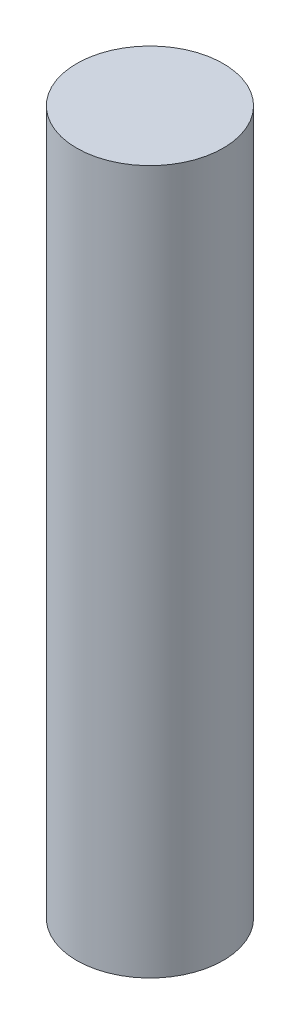
ISO-10303-21;
HEADER;
FILE_DESCRIPTION(('STEP AP214'),'2;1');
FILE_NAME('part.step','',(''),(''),'','','');
FILE_SCHEMA(('AUTOMOTIVE_DESIGN { 1 0 10303 214 1 1 1 1 }'));
ENDSEC;
DATA;
#1=APPLICATION_CONTEXT('core data for automotive mechanical design processes');
#2=APPLICATION_PROTOCOL_DEFINITION('international standard','automotive_design',2000,#1);
#3=PRODUCT_CONTEXT('',#1,'mechanical');
#4=PRODUCT('Part','Part','',(#3));
#5=PRODUCT_RELATED_PRODUCT_CATEGORY('part','',(#4));
#6=PRODUCT_DEFINITION_FORMATION('','',#4);
#7=PRODUCT_DEFINITION_CONTEXT('part definition',#1,'design');
#8=PRODUCT_DEFINITION('design','',#6,#7);
#9=PRODUCT_DEFINITION_SHAPE('','',#8);
#10=(LENGTH_UNIT() NAMED_UNIT(*) SI_UNIT(.MILLI.,.METRE.));
#11=(NAMED_UNIT(*) PLANE_ANGLE_UNIT() SI_UNIT($,.RADIAN.));
#12=(NAMED_UNIT(*) SI_UNIT($,.STERADIAN.) SOLID_ANGLE_UNIT());
#13=UNCERTAINTY_MEASURE_WITH_UNIT(LENGTH_MEASURE(1.E-05),#10,'distance_accuracy_value','');
#14=(GEOMETRIC_REPRESENTATION_CONTEXT(3) GLOBAL_UNCERTAINTY_ASSIGNED_CONTEXT((#13)) GLOBAL_UNIT_ASSIGNED_CONTEXT((#10,
#11,#12)) REPRESENTATION_CONTEXT('',''));
#15=CARTESIAN_POINT('',(0.,0.,0.));
#16=DIRECTION('',(0.,0.,1.));
#17=DIRECTION('',(1.,0.,0.));
#18=AXIS2_PLACEMENT_3D('',#15,#16,#17);
#19=CARTESIAN_POINT('',(0.,76.2,0.));
#20=DIRECTION('',(0.,-1.,0.));
#21=DIRECTION('',(0.,0.,-1.));
#22=AXIS2_PLACEMENT_3D('',#19,#20,#21);
#23=CYLINDRICAL_SURFACE('',#22,7.9375);
#24=CARTESIAN_POINT('',(0.,76.2,0.));
#25=DIRECTION('',(0.,1.,0.));
#26=DIRECTION('',(0.,0.,1.));
#27=AXIS2_PLACEMENT_3D('',#24,#25,#26);
#28=CIRCLE('',#27,7.9375);
#29=CARTESIAN_POINT('',(0.,76.2,7.9375));
#30=VERTEX_POINT('',#29);
#31=EDGE_CURVE('E10',#30,#30,#28,.T.);
#32=ORIENTED_EDGE('',*,*,#31,.F.);
#33=EDGE_LOOP('',(#32));
#34=FACE_BOUND('',#33,.T.);
#35=CARTESIAN_POINT('',(0.,0.,0.));
#36=DIRECTION('',(0.,1.,0.));
#37=DIRECTION('',(0.,0.,1.));
#38=AXIS2_PLACEMENT_3D('',#35,#36,#37);
#39=CIRCLE('',#38,7.9375);
#40=CARTESIAN_POINT('',(0.,0.,7.9375));
#41=VERTEX_POINT('',#40);
#42=EDGE_CURVE('E42',#41,#41,#39,.T.);
#43=ORIENTED_EDGE('',*,*,#42,.T.);
#44=EDGE_LOOP('',(#43));
#45=FACE_BOUND('',#44,.T.);
#46=ADVANCED_FACE('F39',(#34,#45),#23,.T.);
#47=CARTESIAN_POINT('',(0.,76.2,0.));
#48=DIRECTION('',(0.,1.,0.));
#49=DIRECTION('',(0.,0.,1.));
#50=AXIS2_PLACEMENT_3D('',#47,#48,#49);
#51=PLANE('',#50);
#52=ORIENTED_EDGE('',*,*,#31,.T.);
#53=EDGE_LOOP('',(#52));
#54=FACE_BOUND('',#53,.T.);
#55=ADVANCED_FACE('F56',(#54),#51,.T.);
#56=CARTESIAN_POINT('',(0.,0.,0.));
#57=DIRECTION('',(0.,1.,0.));
#58=DIRECTION('',(0.,0.,1.));
#59=AXIS2_PLACEMENT_3D('',#56,#57,#58);
#60=PLANE('',#59);
#61=ORIENTED_EDGE('',*,*,#42,.F.);
#62=EDGE_LOOP('',(#61));
#63=FACE_BOUND('',#62,.T.);
#64=ADVANCED_FACE('F54',(#63),#60,.F.);
#65=CLOSED_SHELL('',(#46,#55,#64));
#66=MANIFOLD_SOLID_BREP('B2',#65);
#67=ADVANCED_BREP_SHAPE_REPRESENTATION('',(#18,#66),#14);
#68=SHAPE_DEFINITION_REPRESENTATION(#9,#67);
ENDSEC;
END-ISO-10303-21;
